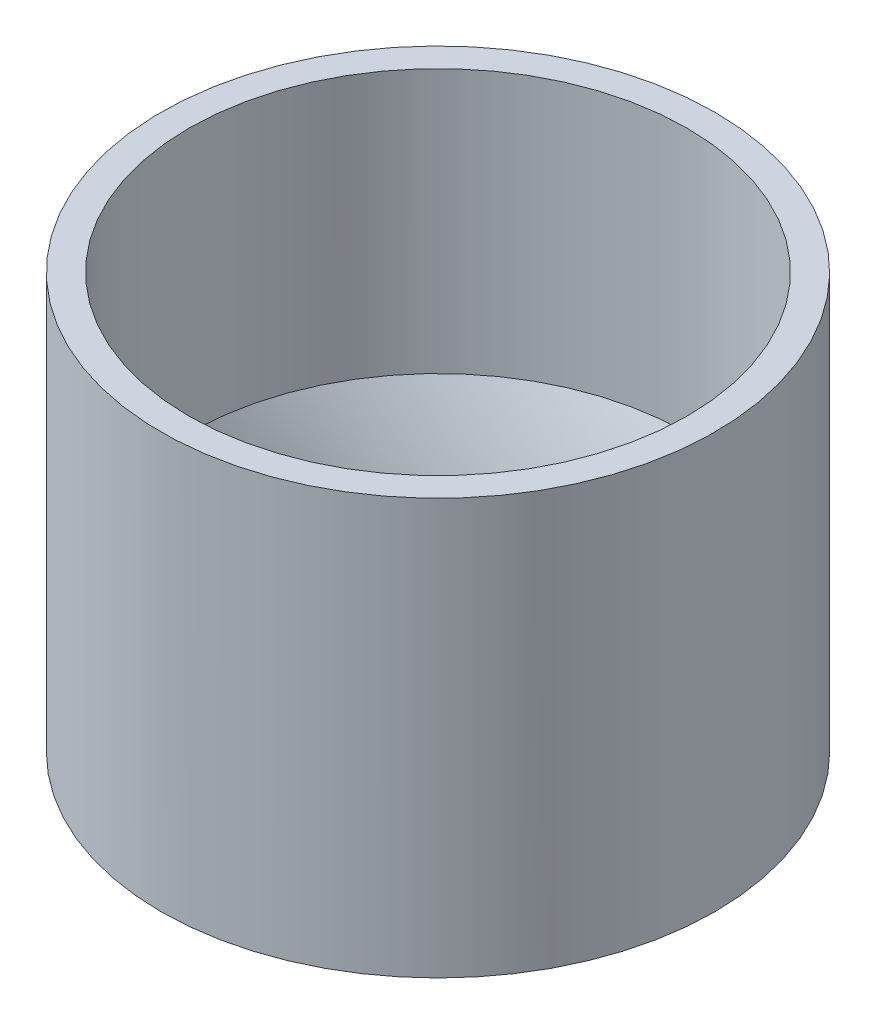
ISO-10303-21;
HEADER;
FILE_DESCRIPTION(('STEP AP214'),'2;1');
FILE_NAME('part.step','',(''),(''),'','','');
FILE_SCHEMA(('AUTOMOTIVE_DESIGN { 1 0 10303 214 1 1 1 1 }'));
ENDSEC;
DATA;
#1=APPLICATION_CONTEXT('core data for automotive mechanical design processes');
#2=APPLICATION_PROTOCOL_DEFINITION('international standard','automotive_design',2000,#1);
#3=PRODUCT_CONTEXT('',#1,'mechanical');
#4=PRODUCT('Part','Part','',(#3));
#5=PRODUCT_RELATED_PRODUCT_CATEGORY('part','',(#4));
#6=PRODUCT_DEFINITION_FORMATION('','',#4);
#7=PRODUCT_DEFINITION_CONTEXT('part definition',#1,'design');
#8=PRODUCT_DEFINITION('design','',#6,#7);
#9=PRODUCT_DEFINITION_SHAPE('','',#8);
#10=(LENGTH_UNIT() NAMED_UNIT(*) SI_UNIT(.MILLI.,.METRE.));
#11=(NAMED_UNIT(*) PLANE_ANGLE_UNIT() SI_UNIT($,.RADIAN.));
#12=(NAMED_UNIT(*) SI_UNIT($,.STERADIAN.) SOLID_ANGLE_UNIT());
#13=UNCERTAINTY_MEASURE_WITH_UNIT(LENGTH_MEASURE(1.E-05),#10,'distance_accuracy_value','');
#14=(GEOMETRIC_REPRESENTATION_CONTEXT(3) GLOBAL_UNCERTAINTY_ASSIGNED_CONTEXT((#13)) GLOBAL_UNIT_ASSIGNED_CONTEXT((#10,
#11,#12)) REPRESENTATION_CONTEXT('',''));
#15=CARTESIAN_POINT('',(0.,0.,0.));
#16=DIRECTION('',(0.,0.,1.));
#17=DIRECTION('',(1.,0.,0.));
#18=AXIS2_PLACEMENT_3D('',#15,#16,#17);
#19=CARTESIAN_POINT('',(-2.76069554209761,0.5,1.17412100051161));
#20=CARTESIAN_POINT('',(-3.99388714027683,3.,-0.221055447187709));
#21=CARTESIAN_POINT('',(-0.412453541074397,0.5,6.69551208470683));
#22=CARTESIAN_POINT('',(-4.43599803465225,3.,7.76671883336595));
#23=CARTESIAN_POINT('',(5.10893754312082,0.5,4.34727008368361));
#24=CARTESIAN_POINT('',(3.55177624590141,3.,8.20882972774137));
#25=CARTESIAN_POINT('',(2.76069554209761,0.5,-1.17412100051161));
#26=CARTESIAN_POINT('',(3.99388714027683,3.,0.221055447187708));
#27=CARTESIAN_POINT('',(0.412453541074398,0.5,-6.69551208470683));
#28=CARTESIAN_POINT('',(4.43599803465225,3.,-7.76671883336595));
#29=CARTESIAN_POINT('',(-5.10893754312083,0.5,-4.34727008368361));
#30=CARTESIAN_POINT('',(-3.55177624590141,3.,-8.20882972774137));
#31=CARTESIAN_POINT('',(-2.76069554209761,0.5,1.17412100051161));
#32=CARTESIAN_POINT('',(-3.99388714027683,3.,-0.221055447187709));
#33=(BOUNDED_SURFACE() B_SPLINE_SURFACE(3,1,((#19,#20),(#21,#22),(#23,#24),(#25,#26),(#27,#28),
(#29,#30),(#31,#32)),.UNSPECIFIED.,.T.,.F.,.F.) B_SPLINE_SURFACE_WITH_KNOTS((4,3,4),(2,2),(0.,
0.5,1.),(0.,1.),.UNSPECIFIED.) GEOMETRIC_REPRESENTATION_ITEM() RATIONAL_B_SPLINE_SURFACE(((1.,
1.),(0.333333333333333,0.333333333333333),(0.333333333333333,0.333333333333333),(1.,1.),
(0.333333333333333,0.333333333333333),(0.333333333333333,0.333333333333333),(1.,1.))) REPRESENTATION_ITEM('') SURFACE());
#34=CARTESIAN_POINT('',(0.,0.918255556058054,0.));
#35=DIRECTION('',(0.,1.,0.));
#36=DIRECTION('',(0.,0.,1.));
#37=AXIS2_PLACEMENT_3D('',#34,#35,#36);
#38=CIRCLE('',#37,3.11256828886881);
#39=CARTESIAN_POINT('',(-2.96701123714664,0.918255556058054,0.940704880138976));
#40=VERTEX_POINT('',#39);
#41=EDGE_CURVE('E45',#40,#40,#38,.F.);
#42=CARTESIAN_POINT('',(0.,2.18617088950679,0.));
#43=DIRECTION('',(0.,1.,0.));
#44=DIRECTION('',(0.,0.,1.));
#45=AXIS2_PLACEMENT_3D('',#42,#43,#44);
#46=CIRCLE('',#45,3.6);
#47=CARTESIAN_POINT('',(-3.59244425171127,2.18617088950679,0.233118635777179));
#48=VERTEX_POINT('',#47);
#49=EDGE_CURVE('E49',#48,#48,#46,.F.);
#50=CARTESIAN_POINT('',(-2.96701123714664,0.918255556058054,0.940704880138976));
#51=CARTESIAN_POINT('',(-2.97352616438169,0.931463007448145,0.933334190093541));
#52=CARTESIAN_POINT('',(-2.98004109161674,0.944670458838236,0.925963500048105));
#53=CARTESIAN_POINT('',(-2.99307094608683,0.971085361618418,0.911222119957235));
#54=CARTESIAN_POINT('',(-2.99958587332188,0.984292813008509,0.903851429911799));
#55=CARTESIAN_POINT('',(-3.01261572779198,1.01070771578869,0.889110049820928));
#56=CARTESIAN_POINT('',(-3.01913065502703,1.02391516717878,0.881739359775493));
#57=CARTESIAN_POINT('',(-3.03216050949712,1.05033006995896,0.866997979684622));
#58=CARTESIAN_POINT('',(-3.03867543673217,1.06353752134905,0.859627289639187));
#59=CARTESIAN_POINT('',(-3.05170529120227,1.08995242412924,0.844885909548316));
#60=CARTESIAN_POINT('',(-3.05822021843731,1.10315987551933,0.837515219502881));
#61=CARTESIAN_POINT('',(-3.07125007290741,1.12957477829951,0.82277383941201));
#62=CARTESIAN_POINT('',(-3.07776500014246,1.1427822296896,0.815403149366574));
#63=CARTESIAN_POINT('',(-3.09079485461256,1.16919713246978,0.800661769275704));
#64=CARTESIAN_POINT('',(-3.0973097818476,1.18240458385987,0.793291079230269));
#65=CARTESIAN_POINT('',(-3.1103396363177,1.20881948664006,0.778549699139398));
#66=CARTESIAN_POINT('',(-3.11685456355275,1.22202693803015,0.771179009093962));
#67=CARTESIAN_POINT('',(-3.12988441802285,1.24844184081033,0.756437629003091));
#68=CARTESIAN_POINT('',(-3.13639934525789,1.26164929220042,0.749066938957656));
#69=CARTESIAN_POINT('',(-3.14942919972799,1.2880641949806,0.734325558866785));
#70=CARTESIAN_POINT('',(-3.15594412696304,1.30127164637069,0.72695486882135));
#71=CARTESIAN_POINT('',(-3.16897398143314,1.32768654915087,0.712213488730479));
#72=CARTESIAN_POINT('',(-3.17548890866818,1.34089400054096,0.704842798685044));
#73=CARTESIAN_POINT('',(-3.18851876313828,1.36730890332115,0.690101418594173));
#74=CARTESIAN_POINT('',(-3.19503369037333,1.38051635471124,0.682730728548738));
#75=CARTESIAN_POINT('',(-3.20806354484342,1.40693125749142,0.667989348457867));
#76=CARTESIAN_POINT('',(-3.21457847207847,1.42013870888151,0.660618658412431));
#77=CARTESIAN_POINT('',(-3.22760832654857,1.44655361166169,0.645877278321561));
#78=CARTESIAN_POINT('',(-3.23412325378362,1.45976106305178,0.638506588276125));
#79=CARTESIAN_POINT('',(-3.24715310825371,1.48617596583196,0.623765208185254));
#80=CARTESIAN_POINT('',(-3.25366803548876,1.49938341722206,0.616394518139819));
#81=CARTESIAN_POINT('',(-3.26669788995886,1.52579832000224,0.601653138048948));
#82=CARTESIAN_POINT('',(-3.27321281719391,1.53900577139233,0.594282448003513));
#83=CARTESIAN_POINT('',(-3.286242671664,1.56542067417251,0.579541067912642));
#84=CARTESIAN_POINT('',(-3.29275759889905,1.5786281255626,0.572170377867207));
#85=CARTESIAN_POINT('',(-3.30578745336915,1.60504302834278,0.557428997776336));
#86=CARTESIAN_POINT('',(-3.3123023806042,1.61825047973287,0.5500583077309));
#87=CARTESIAN_POINT('',(-3.32533223507429,1.64466538251306,0.53531692764003));
#88=CARTESIAN_POINT('',(-3.33184716230934,1.65787283390315,0.527946237594594));
#89=CARTESIAN_POINT('',(-3.34487701677944,1.68428773668333,0.513204857503724));
#90=CARTESIAN_POINT('',(-3.35139194401449,1.69749518807342,0.505834167458288));
#91=CARTESIAN_POINT('',(-3.36442179848458,1.7239100908536,0.491092787367417));
#92=CARTESIAN_POINT('',(-3.37093672571963,1.73711754224369,0.483722097321982));
#93=CARTESIAN_POINT('',(-3.38396658018973,1.76353244502387,0.468980717231111));
#94=CARTESIAN_POINT('',(-3.39048150742477,1.77673989641397,0.461610027185676));
#95=CARTESIAN_POINT('',(-3.40351136189487,1.80315479919415,0.446868647094805));
#96=CARTESIAN_POINT('',(-3.41002628912992,1.81636225058424,0.43949795704937));
#97=CARTESIAN_POINT('',(-3.42305614360002,1.84277715336442,0.424756576958499));
#98=CARTESIAN_POINT('',(-3.42957107083506,1.85598460475451,0.417385886913063));
#99=CARTESIAN_POINT('',(-3.44260092530516,1.88239950753469,0.402644506822193));
#100=CARTESIAN_POINT('',(-3.44911585254021,1.89560695892478,0.395273816776757));
#101=CARTESIAN_POINT('',(-3.46214570701031,1.92202186170497,0.380532436685886));
#102=CARTESIAN_POINT('',(-3.46866063424535,1.93522931309506,0.373161746640451));
#103=CARTESIAN_POINT('',(-3.48169048871545,1.96164421587524,0.35842036654958));
#104=CARTESIAN_POINT('',(-3.4882054159505,1.97485166726533,0.351049676504145));
#105=CARTESIAN_POINT('',(-3.5012352704206,2.00126657004551,0.336308296413274));
#106=CARTESIAN_POINT('',(-3.50775019765564,2.0144740214356,0.328937606367839));
#107=CARTESIAN_POINT('',(-3.52078005212574,2.04088892421579,0.314196226276968));
#108=CARTESIAN_POINT('',(-3.52729497936079,2.05409637560588,0.306825536231532));
#109=CARTESIAN_POINT('',(-3.54032483383088,2.08051127838606,0.292084156140662));
#110=CARTESIAN_POINT('',(-3.54683976106593,2.09371872977615,0.284713466095226));
#111=CARTESIAN_POINT('',(-3.55986961553603,2.12013363255633,0.269972086004356));
#112=CARTESIAN_POINT('',(-3.56638454277108,2.13334108394642,0.26260139595892));
#113=CARTESIAN_POINT('',(-3.57941439724117,2.1597559867266,0.247860015868049));
#114=CARTESIAN_POINT('',(-3.58592932447622,2.17296343811669,0.240489325822614));
#115=CARTESIAN_POINT('',(-3.59244425171127,2.18617088950679,0.233118635777179));
#116=B_SPLINE_CURVE_WITH_KNOTS('',3,(#50,#51,#52,#53,#54,#55,#56,#57,#58,#59,#60,#61,#62,#63,
#64,#65,#66,#67,#68,#69,#70,#71,#72,#73,#74,#75,#76,#77,#78,#79,#80,#81,#82,#83,#84,#85,#86,#87,
#88,#89,#90,#91,#92,#93,#94,#95,#96,#97,#98,#99,#100,#101,#102,#103,#104,#105,#106,#107,#108,
#109,#110,#111,#112,#113,#114,#115),.UNSPECIFIED.,.F.,.F.,(4,2,2,2,2,2,2,2,2,2,2,2,2,2,2,2,2,2,
2,2,2,2,2,2,2,2,2,2,2,2,2,2,4),(0.,0.0494051929214857,0.0988103858429716,0.148215578764457,
0.197620771685943,0.247025964607428,0.296431157528914,0.3458363504504,0.395241543371886,
0.444646736293371,0.494051929214857,0.543457122136343,0.592862315057828,0.642267507979314,
0.6916727009008,0.741077893822286,0.790483086743772,0.839888279665257,0.889293472586743,
0.938698665508228,0.988103858429714,1.0375090513512,1.08691424427269,1.13631943719417,
1.18572463011566,1.23512982303714,1.28453501595863,1.33394020888011,1.3833454018016,
1.43275059472309,1.48215578764457,1.53156098056606,1.58096617348754),.UNSPECIFIED.);
#117=EDGE_CURVE('BSEAM38',#40,#48,#116,.T.);
#118=ORIENTED_EDGE('',*,*,#41,.T.);
#119=ORIENTED_EDGE('',*,*,#49,.F.);
#120=ORIENTED_EDGE('',*,*,#117,.T.);
#121=ORIENTED_EDGE('',*,*,#117,.F.);
#122=EDGE_LOOP('',(#118,#120,#119,#121));
#123=FACE_BOUND('',#122,.T.);
#124=ADVANCED_FACE('F38',(#123),#33,.F.);
#125=CARTESIAN_POINT('',(0.,3.,0.));
#126=DIRECTION('',(0.,-1.,0.));
#127=DIRECTION('',(0.,0.,-1.));
#128=AXIS2_PLACEMENT_3D('',#125,#126,#127);
#129=CYLINDRICAL_SURFACE('',#128,4.);
#130=CARTESIAN_POINT('',(0.,0.,0.));
#131=DIRECTION('',(0.,1.,0.));
#132=DIRECTION('',(0.,0.,1.));
#133=AXIS2_PLACEMENT_3D('',#130,#131,#132);
#134=CIRCLE('',#133,4.);
#135=CARTESIAN_POINT('',(0.,0.,4.));
#136=VERTEX_POINT('',#135);
#137=EDGE_CURVE('E53',#136,#136,#134,.T.);
#138=ORIENTED_EDGE('',*,*,#137,.T.);
#139=EDGE_LOOP('',(#138));
#140=FACE_BOUND('',#139,.T.);
#141=CARTESIAN_POINT('',(0.,6.,0.));
#142=DIRECTION('',(0.,-1.,0.));
#143=DIRECTION('',(0.,0.,-1.));
#144=AXIS2_PLACEMENT_3D('',#141,#142,#143);
#145=CIRCLE('',#144,4.);
#146=CARTESIAN_POINT('',(0.,6.,-4.));
#147=VERTEX_POINT('',#146);
#148=EDGE_CURVE('E60',#147,#147,#145,.T.);
#149=ORIENTED_EDGE('',*,*,#148,.T.);
#150=EDGE_LOOP('',(#149));
#151=FACE_BOUND('',#150,.T.);
#152=ADVANCED_FACE('F77',(#140,#151),#129,.T.);
#153=CARTESIAN_POINT('',(0.,0.,0.));
#154=DIRECTION('',(0.,1.,0.));
#155=DIRECTION('',(0.,0.,1.));
#156=AXIS2_PLACEMENT_3D('',#153,#154,#155);
#157=PLANE('',#156);
#158=ORIENTED_EDGE('',*,*,#137,.F.);
#159=EDGE_LOOP('',(#158));
#160=FACE_BOUND('',#159,.T.);
#161=CARTESIAN_POINT('',(0.,0.,0.));
#162=DIRECTION('',(0.,1.,0.));
#163=DIRECTION('',(0.,0.,1.));
#164=AXIS2_PLACEMENT_3D('',#161,#162,#163);
#165=CIRCLE('',#164,2.);
#166=CARTESIAN_POINT('',(1.47502623471635,0.,-1.35066561624205));
#167=VERTEX_POINT('',#166);
#168=EDGE_CURVE('E59',#167,#167,#165,.T.);
#169=ORIENTED_EDGE('',*,*,#168,.T.);
#170=EDGE_LOOP('',(#169));
#171=FACE_BOUND('',#170,.T.);
#172=ADVANCED_FACE('F67',(#160,#171),#157,.F.);
#173=CARTESIAN_POINT('',(2.08999425886379,3.,-3.41056065741637));
#174=CARTESIAN_POINT('',(1.47502623471635,0.,-1.35066561624205));
#175=CARTESIAN_POINT('',(8.91111557369653,3.,0.769427860311219));
#176=CARTESIAN_POINT('',(4.17635746720045,0.,1.59938685319065));
#177=CARTESIAN_POINT('',(4.73112705596894,3.,7.59054917514396));
#178=CARTESIAN_POINT('',(1.22630499776775,0.,4.30071808567474));
#179=CARTESIAN_POINT('',(-2.08999425886379,3.,3.41056065741637));
#180=CARTESIAN_POINT('',(-1.47502623471635,0.,1.35066561624205));
#181=CARTESIAN_POINT('',(-8.91111557369654,3.,-0.769427860311222));
#182=CARTESIAN_POINT('',(-4.17635746720045,0.,-1.59938685319065));
#183=CARTESIAN_POINT('',(-4.73112705596894,3.,-7.59054917514396));
#184=CARTESIAN_POINT('',(-1.22630499776775,0.,-4.30071808567474));
#185=CARTESIAN_POINT('',(2.08999425886379,3.,-3.41056065741637));
#186=CARTESIAN_POINT('',(1.47502623471635,0.,-1.35066561624205));
#187=(BOUNDED_SURFACE() B_SPLINE_SURFACE(3,1,((#173,#174),(#175,#176),(#177,#178),(#179,#180),
(#181,#182),(#183,#184),(#185,#186)),.UNSPECIFIED.,.T.,.F.,.F.) B_SPLINE_SURFACE_WITH_KNOTS((4,
3,4),(2,2),(0.,0.5,1.),(0.,1.),
.UNSPECIFIED.) GEOMETRIC_REPRESENTATION_ITEM() RATIONAL_B_SPLINE_SURFACE(((1.,1.),
(0.333333333333333,0.333333333333333),(0.333333333333333,0.333333333333333),(1.,1.),
(0.333333333333333,0.333333333333333),(0.333333333333333,0.333333333333333),(1.,1.))) REPRESENTATION_ITEM('') SURFACE());
#188=CARTESIAN_POINT('',(0.,0.5,0.));
#189=DIRECTION('',(0.,-1.,0.));
#190=DIRECTION('',(0.,0.,-1.));
#191=AXIS2_PLACEMENT_3D('',#188,#189,#190);
#192=CIRCLE('',#191,2.31476680936828);
#193=CARTESIAN_POINT('',(1.57752090540759,0.5,-1.69398145643777));
#194=VERTEX_POINT('',#193);
#195=EDGE_CURVE('E56',#194,#194,#192,.F.);
#196=CARTESIAN_POINT('',(1.57752090540759,0.5,-1.69398145643777));
#197=CARTESIAN_POINT('',(1.57645325258789,0.494791666666667,-1.69040524976906));
#198=CARTESIAN_POINT('',(1.57538559976819,0.489583333333334,-1.68682904310036));
#199=CARTESIAN_POINT('',(1.57325029412879,0.479166666666667,-1.67967662976295));
#200=CARTESIAN_POINT('',(1.57218264130909,0.473958333333334,-1.67610042309424));
#201=CARTESIAN_POINT('',(1.57004733566969,0.463541666666667,-1.66894800975683));
#202=CARTESIAN_POINT('',(1.56897968284999,0.458333333333334,-1.66537180308813));
#203=CARTESIAN_POINT('',(1.56684437721058,0.447916666666667,-1.65821938975071));
#204=CARTESIAN_POINT('',(1.56577672439088,0.442708333333333,-1.65464318308201));
#205=CARTESIAN_POINT('',(1.56364141875148,0.432291666666667,-1.6474907697446));
#206=CARTESIAN_POINT('',(1.56257376593178,0.427083333333334,-1.64391456307589));
#207=CARTESIAN_POINT('',(1.56043846029238,0.416666666666667,-1.63676214973848));
#208=CARTESIAN_POINT('',(1.55937080747268,0.411458333333334,-1.63318594306978));
#209=CARTESIAN_POINT('',(1.55723550183328,0.401041666666667,-1.62603352973237));
#210=CARTESIAN_POINT('',(1.55616784901358,0.395833333333334,-1.62245732306366));
#211=CARTESIAN_POINT('',(1.55403254337418,0.385416666666667,-1.61530490972625));
#212=CARTESIAN_POINT('',(1.55296489055448,0.380208333333333,-1.61172870305754));
#213=CARTESIAN_POINT('',(1.55082958491508,0.369791666666667,-1.60457628972013));
#214=CARTESIAN_POINT('',(1.54976193209538,0.364583333333333,-1.60100008305143));
#215=CARTESIAN_POINT('',(1.54762662645598,0.354166666666667,-1.59384766971402));
#216=CARTESIAN_POINT('',(1.54655897363628,0.348958333333333,-1.59027146304531));
#217=CARTESIAN_POINT('',(1.54442366799688,0.338541666666667,-1.5831190497079));
#218=CARTESIAN_POINT('',(1.54335601517718,0.333333333333333,-1.5795428430392));
#219=CARTESIAN_POINT('',(1.54122070953777,0.322916666666667,-1.57239042970178));
#220=CARTESIAN_POINT('',(1.54015305671807,0.317708333333334,-1.56881422303308));
#221=CARTESIAN_POINT('',(1.53801775107867,0.307291666666667,-1.56166180969567));
#222=CARTESIAN_POINT('',(1.53695009825897,0.302083333333333,-1.55808560302696));
#223=CARTESIAN_POINT('',(1.53481479261957,0.291666666666667,-1.55093318968955));
#224=CARTESIAN_POINT('',(1.53374713979987,0.286458333333333,-1.54735698302085));
#225=CARTESIAN_POINT('',(1.53161183416047,0.276041666666667,-1.54020456968344));
#226=CARTESIAN_POINT('',(1.53054418134077,0.270833333333333,-1.53662836301473));
#227=CARTESIAN_POINT('',(1.52840887570137,0.260416666666667,-1.52947594967732));
#228=CARTESIAN_POINT('',(1.52734122288167,0.255208333333333,-1.52589974300861));
#229=CARTESIAN_POINT('',(1.52520591724227,0.244791666666667,-1.5187473296712));
#230=CARTESIAN_POINT('',(1.52413826442257,0.239583333333333,-1.5151711230025));
#231=CARTESIAN_POINT('',(1.52200295878317,0.229166666666667,-1.50801870966509));
#232=CARTESIAN_POINT('',(1.52093530596347,0.223958333333334,-1.50444250299638));
#233=CARTESIAN_POINT('',(1.51880000032407,0.213541666666667,-1.49729008965897));
#234=CARTESIAN_POINT('',(1.51773234750437,0.208333333333333,-1.49371388299027));
#235=CARTESIAN_POINT('',(1.51559704186496,0.197916666666667,-1.48656146965285));
#236=CARTESIAN_POINT('',(1.51452938904526,0.192708333333333,-1.48298526298415));
#237=CARTESIAN_POINT('',(1.51239408340586,0.182291666666667,-1.47583284964674));
#238=CARTESIAN_POINT('',(1.51132643058616,0.177083333333334,-1.47225664297803));
#239=CARTESIAN_POINT('',(1.50919112494676,0.166666666666667,-1.46510422964062));
#240=CARTESIAN_POINT('',(1.50812347212706,0.161458333333333,-1.46152802297192));
#241=CARTESIAN_POINT('',(1.50598816648766,0.151041666666667,-1.45437560963451));
#242=CARTESIAN_POINT('',(1.50492051366796,0.145833333333333,-1.4507994029658));
#243=CARTESIAN_POINT('',(1.50278520802856,0.135416666666667,-1.44364698962839));
#244=CARTESIAN_POINT('',(1.50171755520886,0.130208333333333,-1.44007078295968));
#245=CARTESIAN_POINT('',(1.49958224956946,0.119791666666667,-1.43291836962227));
#246=CARTESIAN_POINT('',(1.49851459674976,0.114583333333333,-1.42934216295357));
#247=CARTESIAN_POINT('',(1.49637929111036,0.104166666666667,-1.42218974961616));
#248=CARTESIAN_POINT('',(1.49531163829066,0.0989583333333334,-1.41861354294745));
#249=CARTESIAN_POINT('',(1.49317633265126,0.0885416666666667,-1.41146112961004));
#250=CARTESIAN_POINT('',(1.49210867983155,0.0833333333333335,-1.40788492294134));
#251=CARTESIAN_POINT('',(1.48997337419215,0.0729166666666669,-1.40073250960392));
#252=CARTESIAN_POINT('',(1.48890572137245,0.0677083333333335,-1.39715630293522));
#253=CARTESIAN_POINT('',(1.48677041573305,0.0572916666666667,-1.39000388959781));
#254=CARTESIAN_POINT('',(1.48570276291335,0.0520833333333334,-1.3864276829291));
#255=CARTESIAN_POINT('',(1.48356745727395,0.0416666666666667,-1.37927526959169));
#256=CARTESIAN_POINT('',(1.48249980445425,0.0364583333333335,-1.37569906292299));
#257=CARTESIAN_POINT('',(1.48036449881485,0.0260416666666669,-1.36854664958558));
#258=CARTESIAN_POINT('',(1.47929684599515,0.0208333333333335,-1.36497044291687));
#259=CARTESIAN_POINT('',(1.47716154035575,0.0104166666666667,-1.35781802957946));
#260=CARTESIAN_POINT('',(1.47609388753605,0.00520833333333337,-1.35424182291075));
#261=CARTESIAN_POINT('',(1.47502623471635,0.,-1.35066561624205));
#262=B_SPLINE_CURVE_WITH_KNOTS('',3,(#196,#197,#198,#199,#200,#201,#202,#203,#204,#205,#206,
#207,#208,#209,#210,#211,#212,#213,#214,#215,#216,#217,#218,#219,#220,#221,#222,#223,#224,#225,
#226,#227,#228,#229,#230,#231,#232,#233,#234,#235,#236,#237,#238,#239,#240,#241,#242,#243,#244,
#245,#246,#247,#248,#249,#250,#251,#252,#253,#254,#255,#256,#257,#258,#259,#260,#261),
.UNSPECIFIED.,.F.,.F.,(4,2,2,2,2,2,2,2,2,2,2,2,2,2,2,2,2,2,2,2,2,2,2,2,2,2,2,2,2,2,2,2,4),(0.,
0.0192224570522702,0.0384449141045399,0.0576673711568102,0.0768898282090803,0.0961122852613502,
0.11533474231362,0.134557199365891,0.153779656418161,0.17300211347043,0.192224570522701,
0.211447027574971,0.230669484627241,0.249891941679511,0.269114398731781,0.288336855784051,
0.307559312836321,0.326781769888591,0.346004226940861,0.365226683993131,0.384449141045401,
0.403671598097671,0.422894055149941,0.442116512202211,0.461338969254481,0.480561426306751,
0.499783883359021,0.519006340411291,0.538228797463561,0.557451254515832,0.576673711568101,
0.595896168620372,0.615118625672642),.UNSPECIFIED.);
#263=EDGE_CURVE('BSEAM76',#194,#167,#262,.T.);
#264=ORIENTED_EDGE('',*,*,#195,.T.);
#265=ORIENTED_EDGE('',*,*,#168,.F.);
#266=ORIENTED_EDGE('',*,*,#263,.T.);
#267=ORIENTED_EDGE('',*,*,#263,.F.);
#268=EDGE_LOOP('',(#264,#266,#265,#267));
#269=FACE_BOUND('',#268,.T.);
#270=ADVANCED_FACE('F76',(#269),#187,.F.);
#271=CARTESIAN_POINT('',(0.,0.5,0.));
#272=DIRECTION('',(0.,-1.,0.));
#273=DIRECTION('',(0.,0.,-1.));
#274=AXIS2_PLACEMENT_3D('',#271,#272,#273);
#275=PLANE('',#274);
#276=CARTESIAN_POINT('',(0.,0.5,0.));
#277=DIRECTION('',(0.,-1.,0.));
#278=DIRECTION('',(0.,0.,-1.));
#279=AXIS2_PLACEMENT_3D('',#276,#277,#278);
#280=CIRCLE('',#279,2.31568338651313);
#281=CARTESIAN_POINT('',(0.,0.5,-2.31568338651313));
#282=VERTEX_POINT('',#281);
#283=EDGE_CURVE('E11',#282,#282,#280,.F.);
#284=ORIENTED_EDGE('',*,*,#283,.T.);
#285=EDGE_LOOP('',(#284));
#286=FACE_BOUND('',#285,.T.);
#287=ORIENTED_EDGE('',*,*,#195,.F.);
#288=EDGE_LOOP('',(#287));
#289=FACE_BOUND('',#288,.T.);
#290=ADVANCED_FACE('F114',(#286,#289),#275,.F.);
#291=CARTESIAN_POINT('',(0.,6.,0.));
#292=DIRECTION('',(0.,-1.,0.));
#293=DIRECTION('',(0.,0.,-1.));
#294=AXIS2_PLACEMENT_3D('',#291,#292,#293);
#295=CYLINDRICAL_SURFACE('',#294,3.6);
#296=CARTESIAN_POINT('',(0.,6.,0.));
#297=DIRECTION('',(0.,-1.,0.));
#298=DIRECTION('',(0.,0.,-1.));
#299=AXIS2_PLACEMENT_3D('',#296,#297,#298);
#300=CIRCLE('',#299,3.6);
#301=CARTESIAN_POINT('',(0.,6.,-3.6));
#302=VERTEX_POINT('',#301);
#303=EDGE_CURVE('E94',#302,#302,#300,.T.);
#304=ORIENTED_EDGE('',*,*,#303,.F.);
#305=EDGE_LOOP('',(#304));
#306=FACE_BOUND('',#305,.T.);
#307=ORIENTED_EDGE('',*,*,#49,.T.);
#308=EDGE_LOOP('',(#307));
#309=FACE_BOUND('',#308,.T.);
#310=ADVANCED_FACE('F119',(#306,#309),#295,.F.);
#311=CARTESIAN_POINT('',(0.,6.,0.));
#312=DIRECTION('',(0.,-1.,0.));
#313=DIRECTION('',(0.,0.,-1.));
#314=AXIS2_PLACEMENT_3D('',#311,#312,#313);
#315=PLANE('',#314);
#316=ORIENTED_EDGE('',*,*,#303,.T.);
#317=EDGE_LOOP('',(#316));
#318=FACE_BOUND('',#317,.T.);
#319=ORIENTED_EDGE('',*,*,#148,.F.);
#320=EDGE_LOOP('',(#319));
#321=FACE_BOUND('',#320,.T.);
#322=ADVANCED_FACE('F126',(#318,#321),#315,.F.);
#323=CARTESIAN_POINT('',(0.,0.918255556058053,0.));
#324=DIRECTION('',(0.,1.,0.));
#325=DIRECTION('',(0.,0.,1.));
#326=AXIS2_PLACEMENT_3D('',#323,#324,#325);
#327=CONICAL_SURFACE('',#326,3.11256828886881,1.08745657657607);
#328=ORIENTED_EDGE('',*,*,#283,.F.);
#329=EDGE_LOOP('',(#328));
#330=FACE_BOUND('',#329,.T.);
#331=ORIENTED_EDGE('',*,*,#41,.F.);
#332=EDGE_LOOP('',(#331));
#333=FACE_BOUND('',#332,.T.);
#334=ADVANCED_FACE('F40',(#330,#333),#327,.F.);
#335=CLOSED_SHELL('',(#124,#152,#172,#270,#290,#310,#322,#334));
#336=MANIFOLD_SOLID_BREP('B2',#335);
#337=ADVANCED_BREP_SHAPE_REPRESENTATION('',(#18,#336),#14);
#338=SHAPE_DEFINITION_REPRESENTATION(#9,#337);
ENDSEC;
END-ISO-10303-21;
